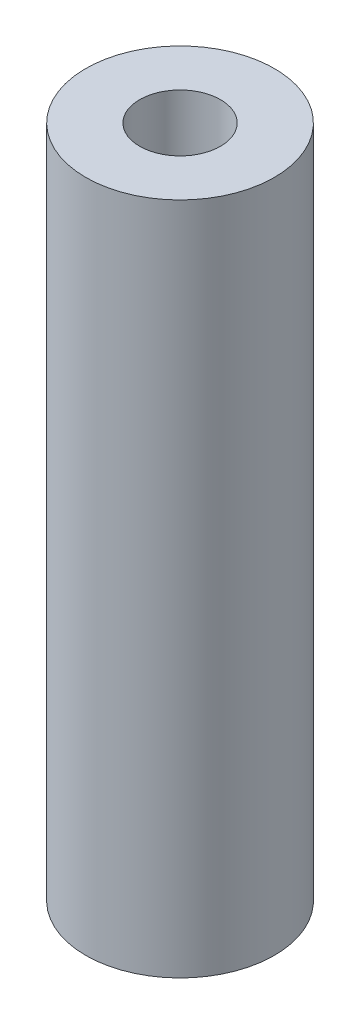
ISO-10303-21;
HEADER;
FILE_DESCRIPTION(('STEP AP214'),'2;1');
FILE_NAME('part.step','',(''),(''),'','','');
FILE_SCHEMA(('AUTOMOTIVE_DESIGN { 1 0 10303 214 1 1 1 1 }'));
ENDSEC;
DATA;
#1=APPLICATION_CONTEXT('core data for automotive mechanical design processes');
#2=APPLICATION_PROTOCOL_DEFINITION('international standard','automotive_design',2000,#1);
#3=PRODUCT_CONTEXT('',#1,'mechanical');
#4=PRODUCT('Part','Part','',(#3));
#5=PRODUCT_RELATED_PRODUCT_CATEGORY('part','',(#4));
#6=PRODUCT_DEFINITION_FORMATION('','',#4);
#7=PRODUCT_DEFINITION_CONTEXT('part definition',#1,'design');
#8=PRODUCT_DEFINITION('design','',#6,#7);
#9=PRODUCT_DEFINITION_SHAPE('','',#8);
#10=(LENGTH_UNIT() NAMED_UNIT(*) SI_UNIT(.MILLI.,.METRE.));
#11=(NAMED_UNIT(*) PLANE_ANGLE_UNIT() SI_UNIT($,.RADIAN.));
#12=(NAMED_UNIT(*) SI_UNIT($,.STERADIAN.) SOLID_ANGLE_UNIT());
#13=UNCERTAINTY_MEASURE_WITH_UNIT(LENGTH_MEASURE(1.E-05),#10,'distance_accuracy_value','');
#14=(GEOMETRIC_REPRESENTATION_CONTEXT(3) GLOBAL_UNCERTAINTY_ASSIGNED_CONTEXT((#13)) GLOBAL_UNIT_ASSIGNED_CONTEXT((#10,
#11,#12)) REPRESENTATION_CONTEXT('',''));
#15=CARTESIAN_POINT('',(0.,0.,0.));
#16=DIRECTION('',(0.,0.,1.));
#17=DIRECTION('',(1.,0.,0.));
#18=AXIS2_PLACEMENT_3D('',#15,#16,#17);
#19=CARTESIAN_POINT('',(-2.29310344827586,25.,-1.3426724137931));
#20=DIRECTION('',(0.,1.,0.));
#21=DIRECTION('',(0.,0.,1.));
#22=AXIS2_PLACEMENT_3D('',#19,#20,#21);
#23=PLANE('',#22);
#24=CARTESIAN_POINT('',(-2.29310344827586,25.,-1.3426724137931));
#25=DIRECTION('',(0.,1.,0.));
#26=DIRECTION('',(0.,0.,1.));
#27=AXIS2_PLACEMENT_3D('',#24,#25,#26);
#28=CIRCLE('',#27,3.5);
#29=CARTESIAN_POINT('',(-2.29310344827586,25.,2.1573275862069));
#30=VERTEX_POINT('',#29);
#31=EDGE_CURVE('E10',#30,#30,#28,.T.);
#32=ORIENTED_EDGE('',*,*,#31,.T.);
#33=EDGE_LOOP('',(#32));
#34=FACE_BOUND('',#33,.T.);
#35=CARTESIAN_POINT('',(-2.29310344827586,25.,-1.3426724137931));
#36=DIRECTION('',(0.,1.,0.));
#37=DIRECTION('',(0.,0.,1.));
#38=AXIS2_PLACEMENT_3D('',#35,#36,#37);
#39=CIRCLE('',#38,1.5);
#40=CARTESIAN_POINT('',(-2.29310344827586,25.,0.157327586206897));
#41=VERTEX_POINT('',#40);
#42=EDGE_CURVE('E56',#41,#41,#39,.T.);
#43=ORIENTED_EDGE('',*,*,#42,.F.);
#44=EDGE_LOOP('',(#43));
#45=FACE_BOUND('',#44,.T.);
#46=ADVANCED_FACE('F43',(#34,#45),#23,.T.);
#47=CARTESIAN_POINT('',(-2.29310344827586,0.,-1.3426724137931));
#48=DIRECTION('',(0.,1.,0.));
#49=DIRECTION('',(0.,0.,1.));
#50=AXIS2_PLACEMENT_3D('',#47,#48,#49);
#51=PLANE('',#50);
#52=CARTESIAN_POINT('',(-2.29310344827586,0.,-1.3426724137931));
#53=DIRECTION('',(0.,1.,0.));
#54=DIRECTION('',(0.,0.,1.));
#55=AXIS2_PLACEMENT_3D('',#52,#53,#54);
#56=CIRCLE('',#55,3.5);
#57=CARTESIAN_POINT('',(-2.29310344827586,0.,2.1573275862069));
#58=VERTEX_POINT('',#57);
#59=EDGE_CURVE('E47',#58,#58,#56,.T.);
#60=ORIENTED_EDGE('',*,*,#59,.F.);
#61=EDGE_LOOP('',(#60));
#62=FACE_BOUND('',#61,.T.);
#63=CARTESIAN_POINT('',(-2.29310344827586,0.,-1.3426724137931));
#64=DIRECTION('',(0.,1.,0.));
#65=DIRECTION('',(0.,0.,1.));
#66=AXIS2_PLACEMENT_3D('',#63,#64,#65);
#67=CIRCLE('',#66,1.5);
#68=CARTESIAN_POINT('',(-2.29310344827586,0.,0.157327586206897));
#69=VERTEX_POINT('',#68);
#70=EDGE_CURVE('E58',#69,#69,#67,.T.);
#71=ORIENTED_EDGE('',*,*,#70,.T.);
#72=EDGE_LOOP('',(#71));
#73=FACE_BOUND('',#72,.T.);
#74=ADVANCED_FACE('F70',(#62,#73),#51,.F.);
#75=CARTESIAN_POINT('',(-2.29310344827586,25.,-1.3426724137931));
#76=DIRECTION('',(0.,-1.,0.));
#77=DIRECTION('',(0.,0.,-1.));
#78=AXIS2_PLACEMENT_3D('',#75,#76,#77);
#79=CYLINDRICAL_SURFACE('',#78,3.5);
#80=ORIENTED_EDGE('',*,*,#31,.F.);
#81=EDGE_LOOP('',(#80));
#82=FACE_BOUND('',#81,.T.);
#83=ORIENTED_EDGE('',*,*,#59,.T.);
#84=EDGE_LOOP('',(#83));
#85=FACE_BOUND('',#84,.T.);
#86=ADVANCED_FACE('F45',(#82,#85),#79,.T.);
#87=CARTESIAN_POINT('',(-2.29310344827586,25.,-1.3426724137931));
#88=DIRECTION('',(0.,-1.,0.));
#89=DIRECTION('',(0.,0.,-1.));
#90=AXIS2_PLACEMENT_3D('',#87,#88,#89);
#91=CYLINDRICAL_SURFACE('',#90,1.5);
#92=ORIENTED_EDGE('',*,*,#42,.T.);
#93=EDGE_LOOP('',(#92));
#94=FACE_BOUND('',#93,.T.);
#95=ORIENTED_EDGE('',*,*,#70,.F.);
#96=EDGE_LOOP('',(#95));
#97=FACE_BOUND('',#96,.T.);
#98=ADVANCED_FACE('F66',(#94,#97),#91,.F.);
#99=CLOSED_SHELL('',(#46,#74,#86,#98));
#100=MANIFOLD_SOLID_BREP('B2',#99);
#101=ADVANCED_BREP_SHAPE_REPRESENTATION('',(#18,#100),#14);
#102=SHAPE_DEFINITION_REPRESENTATION(#9,#101);
ENDSEC;
END-ISO-10303-21;
